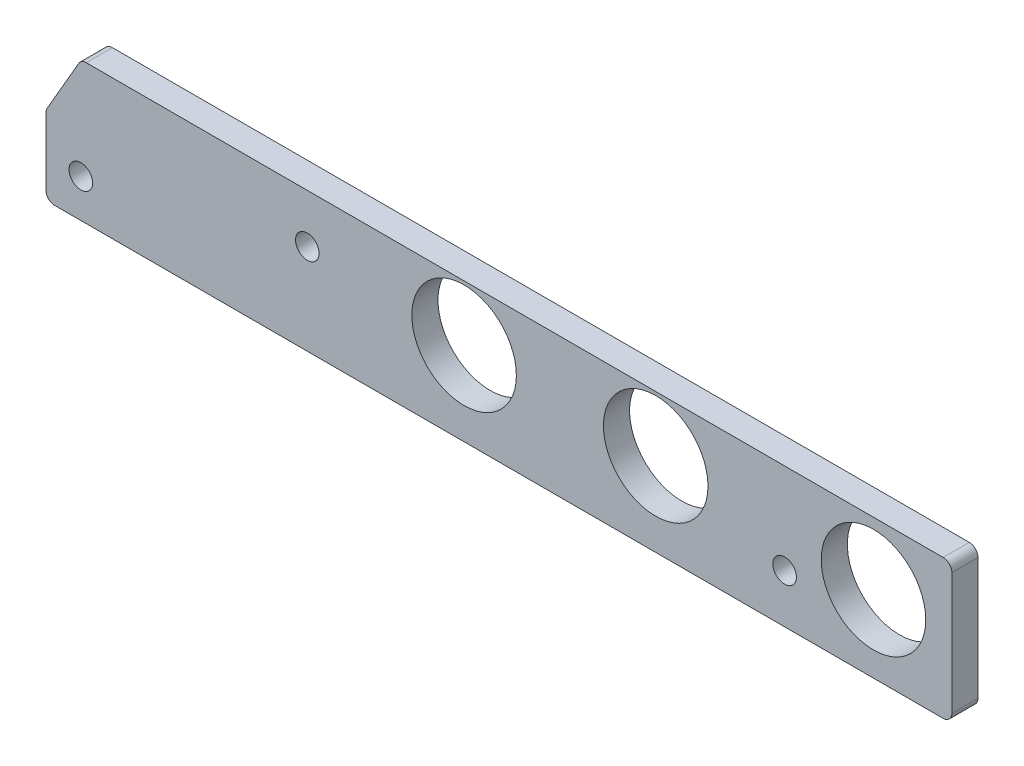
ISO-10303-21;
HEADER;
FILE_DESCRIPTION(('STEP AP214'),'2;1');
FILE_NAME('part.step','',(''),(''),'','','');
FILE_SCHEMA(('AUTOMOTIVE_DESIGN { 1 0 10303 214 1 1 1 1 }'));
ENDSEC;
DATA;
#1=APPLICATION_CONTEXT('core data for automotive mechanical design processes');
#2=APPLICATION_PROTOCOL_DEFINITION('international standard','automotive_design',2000,#1);
#3=PRODUCT_CONTEXT('',#1,'mechanical');
#4=PRODUCT('Part','Part','',(#3));
#5=PRODUCT_RELATED_PRODUCT_CATEGORY('part','',(#4));
#6=PRODUCT_DEFINITION_FORMATION('','',#4);
#7=PRODUCT_DEFINITION_CONTEXT('part definition',#1,'design');
#8=PRODUCT_DEFINITION('design','',#6,#7);
#9=PRODUCT_DEFINITION_SHAPE('','',#8);
#10=(LENGTH_UNIT() NAMED_UNIT(*) SI_UNIT(.MILLI.,.METRE.));
#11=(NAMED_UNIT(*) PLANE_ANGLE_UNIT() SI_UNIT($,.RADIAN.));
#12=(NAMED_UNIT(*) SI_UNIT($,.STERADIAN.) SOLID_ANGLE_UNIT());
#13=UNCERTAINTY_MEASURE_WITH_UNIT(LENGTH_MEASURE(1.E-05),#10,'distance_accuracy_value','');
#14=(GEOMETRIC_REPRESENTATION_CONTEXT(3) GLOBAL_UNCERTAINTY_ASSIGNED_CONTEXT((#13)) GLOBAL_UNIT_ASSIGNED_CONTEXT((#10,
#11,#12)) REPRESENTATION_CONTEXT('',''));
#15=CARTESIAN_POINT('',(0.,0.,0.));
#16=DIRECTION('',(0.,0.,1.));
#17=DIRECTION('',(1.,0.,0.));
#18=AXIS2_PLACEMENT_3D('',#15,#16,#17);
#19=CARTESIAN_POINT('',(-157.767651581292,-1.58749999999997,4.76249999999984));
#20=DIRECTION('',(0.,0.,-1.00000000000001));
#21=DIRECTION('',(-1.,0.,0.));
#22=AXIS2_PLACEMENT_3D('',#19,#20,#21);
#23=CYLINDRICAL_SURFACE('',#22,1.58749999999995);
#24=CARTESIAN_POINT('',(-157.767651581292,-1.58749999999998,-1.90819582357449E-13));
#25=DIRECTION('',(0.,0.,1.00000000000001));
#26=DIRECTION('',(1.,0.,0.));
#27=AXIS2_PLACEMENT_3D('',#24,#25,#26);
#28=CIRCLE('',#27,1.58749999999995);
#29=CARTESIAN_POINT('',(-157.767651581292,0.,-1.90819582357449E-13));
#30=VERTEX_POINT('',#29);
#31=CARTESIAN_POINT('',(-159.1424669098,-0.793749999999945,-1.90819582357449E-13));
#32=VERTEX_POINT('',#31);
#33=EDGE_CURVE('E144',#30,#32,#28,.T.);
#34=ORIENTED_EDGE('',*,*,#33,.T.);
#35=DIRECTION('',(0.,0.,-1.00000000000001));
#36=VECTOR('',#35,1.);
#37=CARTESIAN_POINT('',(-159.1424669098,-0.793749999999938,4.76249999999984));
#38=LINE('',#37,#36);
#39=CARTESIAN_POINT('',(-159.1424669098,-0.793749999999938,4.76249999999984));
#40=VERTEX_POINT('',#39);
#41=EDGE_CURVE('E11',#40,#32,#38,.T.);
#42=ORIENTED_EDGE('',*,*,#41,.F.);
#43=CARTESIAN_POINT('',(-157.767651581292,-1.58749999999997,4.76249999999984));
#44=DIRECTION('',(0.,0.,1.00000000000001));
#45=DIRECTION('',(1.,0.,0.));
#46=AXIS2_PLACEMENT_3D('',#43,#44,#45);
#47=CIRCLE('',#46,1.58749999999995);
#48=CARTESIAN_POINT('',(-157.767651581292,0.,4.76249999999984));
#49=VERTEX_POINT('',#48);
#50=EDGE_CURVE('E163',#49,#40,#47,.T.);
#51=ORIENTED_EDGE('',*,*,#50,.F.);
#52=DIRECTION('',(0.,0.,-1.00000000000001));
#53=VECTOR('',#52,1.);
#54=CARTESIAN_POINT('',(-157.767651581292,0.,4.76249999999984));
#55=LINE('',#54,#53);
#56=EDGE_CURVE('E140',#49,#30,#55,.T.);
#57=ORIENTED_EDGE('',*,*,#56,.T.);
#58=EDGE_LOOP('',(#34,#42,#51,#57));
#59=FACE_BOUND('',#58,.T.);
#60=ADVANCED_FACE('F36',(#59),#23,.T.);
#61=CARTESIAN_POINT('',(-159.1424669098,-0.793749999999938,4.76249999999984));
#62=DIRECTION('',(0.866025403784437,-0.5,0.));
#63=DIRECTION('',(0.5,0.866025403784441,0.));
#64=AXIS2_PLACEMENT_3D('',#61,#62,#63);
#65=PLANE('',#64);
#66=DIRECTION('',(-0.5,-0.866025403784441,0.));
#67=VECTOR('',#66,1.);
#68=CARTESIAN_POINT('',(-159.1424669098,-0.793749999999945,-1.90819582357449E-13));
#69=LINE('',#68,#67);
#70=CARTESIAN_POINT('',(-164.887315328508,-10.7441193429844,-2.0122792321331E-13));
#71=VERTEX_POINT('',#70);
#72=EDGE_CURVE('E147',#32,#71,#69,.T.);
#73=ORIENTED_EDGE('',*,*,#72,.T.);
#74=DIRECTION('',(0.,0.,-1.00000000000001));
#75=VECTOR('',#74,1.);
#76=CARTESIAN_POINT('',(-164.887315328508,-10.7441193429844,4.76249999999983));
#77=LINE('',#76,#75);
#78=CARTESIAN_POINT('',(-164.887315328508,-10.7441193429844,4.76249999999983));
#79=VERTEX_POINT('',#78);
#80=EDGE_CURVE('E44',#79,#71,#77,.T.);
#81=ORIENTED_EDGE('',*,*,#80,.F.);
#82=DIRECTION('',(-0.5,-0.866025403784441,0.));
#83=VECTOR('',#82,1.);
#84=CARTESIAN_POINT('',(-159.1424669098,-0.793749999999938,4.76249999999984));
#85=LINE('',#84,#83);
#86=EDGE_CURVE('E101',#40,#79,#85,.T.);
#87=ORIENTED_EDGE('',*,*,#86,.F.);
#88=ORIENTED_EDGE('',*,*,#41,.T.);
#89=EDGE_LOOP('',(#73,#81,#87,#88));
#90=FACE_BOUND('',#89,.T.);
#91=ADVANCED_FACE('F278',(#90),#65,.F.);
#92=CARTESIAN_POINT('',(-163.5125,-11.5378693429844,4.76249999999982));
#93=DIRECTION('',(0.,0.,-1.00000000000001));
#94=DIRECTION('',(-1.,0.,0.));
#95=AXIS2_PLACEMENT_3D('',#92,#93,#94);
#96=CYLINDRICAL_SURFACE('',#95,1.5875);
#97=CARTESIAN_POINT('',(-163.5125,-11.5378693429844,-2.0122792321331E-13));
#98=DIRECTION('',(0.,0.,1.00000000000001));
#99=DIRECTION('',(1.,0.,0.));
#100=AXIS2_PLACEMENT_3D('',#97,#98,#99);
#101=CIRCLE('',#100,1.5875);
#102=CARTESIAN_POINT('',(-165.1,-11.5378693429844,-2.04697370165263E-13));
#103=VERTEX_POINT('',#102);
#104=EDGE_CURVE('E150',#71,#103,#101,.T.);
#105=ORIENTED_EDGE('',*,*,#104,.T.);
#106=DIRECTION('',(0.,0.,-1.00000000000001));
#107=VECTOR('',#106,1.);
#108=CARTESIAN_POINT('',(-165.1,-11.5378693429844,4.76249999999982));
#109=LINE('',#108,#107);
#110=CARTESIAN_POINT('',(-165.1,-11.5378693429844,4.76249999999982));
#111=VERTEX_POINT('',#110);
#112=EDGE_CURVE('E176',#111,#103,#109,.T.);
#113=ORIENTED_EDGE('',*,*,#112,.F.);
#114=CARTESIAN_POINT('',(-163.5125,-11.5378693429844,4.76249999999982));
#115=DIRECTION('',(0.,0.,1.00000000000001));
#116=DIRECTION('',(1.,0.,0.));
#117=AXIS2_PLACEMENT_3D('',#114,#115,#116);
#118=CIRCLE('',#117,1.5875);
#119=EDGE_CURVE('E184',#79,#111,#118,.T.);
#120=ORIENTED_EDGE('',*,*,#119,.F.);
#121=ORIENTED_EDGE('',*,*,#80,.T.);
#122=EDGE_LOOP('',(#105,#113,#120,#121));
#123=FACE_BOUND('',#122,.T.);
#124=ADVANCED_FACE('F182',(#123),#96,.T.);
#125=CARTESIAN_POINT('',(-165.1,-11.5378693429844,4.76249999999982));
#126=DIRECTION('',(1.,0.,0.));
#127=DIRECTION('',(0.,0.,-1.00000000000001));
#128=AXIS2_PLACEMENT_3D('',#125,#126,#127);
#129=PLANE('',#128);
#130=DIRECTION('',(0.,-1.,0.));
#131=VECTOR('',#130,1.);
#132=CARTESIAN_POINT('',(-165.1,-11.5378693429844,-2.04697370165263E-13));
#133=LINE('',#132,#131);
#134=CARTESIAN_POINT('',(-165.1,-23.8125000000001,-2.39391839684799E-13));
#135=VERTEX_POINT('',#134);
#136=EDGE_CURVE('E152',#103,#135,#133,.T.);
#137=ORIENTED_EDGE('',*,*,#136,.T.);
#138=DIRECTION('',(0.,0.,-1.00000000000001));
#139=VECTOR('',#138,1.);
#140=CARTESIAN_POINT('',(-165.1,-23.8125000000001,4.76249999999978));
#141=LINE('',#140,#139);
#142=CARTESIAN_POINT('',(-165.1,-23.8125000000001,4.76249999999978));
#143=VERTEX_POINT('',#142);
#144=EDGE_CURVE('E173',#143,#135,#141,.T.);
#145=ORIENTED_EDGE('',*,*,#144,.F.);
#146=DIRECTION('',(0.,-1.,0.));
#147=VECTOR('',#146,1.);
#148=CARTESIAN_POINT('',(-165.1,-11.5378693429844,4.76249999999982));
#149=LINE('',#148,#147);
#150=EDGE_CURVE('E202',#111,#143,#149,.T.);
#151=ORIENTED_EDGE('',*,*,#150,.F.);
#152=ORIENTED_EDGE('',*,*,#112,.T.);
#153=EDGE_LOOP('',(#137,#145,#151,#152));
#154=FACE_BOUND('',#153,.T.);
#155=ADVANCED_FACE('F193',(#154),#129,.F.);
#156=CARTESIAN_POINT('',(-163.5125,-23.8125000000001,4.76249999999978));
#157=DIRECTION('',(0.,0.,-1.00000000000001));
#158=DIRECTION('',(-1.,0.,0.));
#159=AXIS2_PLACEMENT_3D('',#156,#157,#158);
#160=CYLINDRICAL_SURFACE('',#159,1.58749999999999);
#161=CARTESIAN_POINT('',(-163.5125,-23.8125000000001,-2.39391839684799E-13));
#162=DIRECTION('',(0.,0.,1.00000000000001));
#163=DIRECTION('',(1.,0.,0.));
#164=AXIS2_PLACEMENT_3D('',#161,#162,#163);
#165=CIRCLE('',#164,1.58749999999999);
#166=CARTESIAN_POINT('',(-163.5125,-25.4,-2.39391839684799E-13));
#167=VERTEX_POINT('',#166);
#168=EDGE_CURVE('E154',#135,#167,#165,.T.);
#169=ORIENTED_EDGE('',*,*,#168,.T.);
#170=DIRECTION('',(0.,0.,-1.00000000000001));
#171=VECTOR('',#170,1.);
#172=CARTESIAN_POINT('',(-163.5125,-25.4,4.76249999999978));
#173=LINE('',#172,#171);
#174=CARTESIAN_POINT('',(-163.5125,-25.4,4.76249999999978));
#175=VERTEX_POINT('',#174);
#176=EDGE_CURVE('E170',#175,#167,#173,.T.);
#177=ORIENTED_EDGE('',*,*,#176,.F.);
#178=CARTESIAN_POINT('',(-163.5125,-23.8125000000001,4.76249999999978));
#179=DIRECTION('',(0.,0.,1.00000000000001));
#180=DIRECTION('',(1.,0.,0.));
#181=AXIS2_PLACEMENT_3D('',#178,#179,#180);
#182=CIRCLE('',#181,1.58749999999999);
#183=EDGE_CURVE('E199',#143,#175,#182,.T.);
#184=ORIENTED_EDGE('',*,*,#183,.F.);
#185=ORIENTED_EDGE('',*,*,#144,.T.);
#186=EDGE_LOOP('',(#169,#177,#184,#185));
#187=FACE_BOUND('',#186,.T.);
#188=ADVANCED_FACE('F197',(#187),#160,.T.);
#189=CARTESIAN_POINT('',(-163.5125,-25.4,4.76249999999978));
#190=DIRECTION('',(0.,1.,0.));
#191=DIRECTION('',(-1.,0.,0.));
#192=AXIS2_PLACEMENT_3D('',#189,#190,#191);
#193=PLANE('',#192);
#194=DIRECTION('',(1.,0.,0.));
#195=VECTOR('',#194,1.);
#196=CARTESIAN_POINT('',(-163.5125,-25.4,-2.39391839684799E-13));
#197=LINE('',#196,#195);
#198=CARTESIAN_POINT('',(-1.5875,-25.4,0.));
#199=VERTEX_POINT('',#198);
#200=EDGE_CURVE('E156',#167,#199,#197,.T.);
#201=ORIENTED_EDGE('',*,*,#200,.T.);
#202=DIRECTION('',(0.,0.,-1.00000000000001));
#203=VECTOR('',#202,1.);
#204=CARTESIAN_POINT('',(-1.5875,-25.4,4.76249999999999));
#205=LINE('',#204,#203);
#206=CARTESIAN_POINT('',(-1.5875,-25.4,4.76249999999999));
#207=VERTEX_POINT('',#206);
#208=EDGE_CURVE('E167',#207,#199,#205,.T.);
#209=ORIENTED_EDGE('',*,*,#208,.F.);
#210=DIRECTION('',(1.,0.,0.));
#211=VECTOR('',#210,1.);
#212=CARTESIAN_POINT('',(-163.5125,-25.4,4.76249999999978));
#213=LINE('',#212,#211);
#214=EDGE_CURVE('E201',#175,#207,#213,.T.);
#215=ORIENTED_EDGE('',*,*,#214,.F.);
#216=ORIENTED_EDGE('',*,*,#176,.T.);
#217=EDGE_LOOP('',(#201,#209,#215,#216));
#218=FACE_BOUND('',#217,.T.);
#219=ADVANCED_FACE('F290',(#218),#193,.F.);
#220=CARTESIAN_POINT('',(-1.5875,-23.8125,4.7625));
#221=DIRECTION('',(0.,0.,-1.00000000000001));
#222=DIRECTION('',(-1.,0.,0.));
#223=AXIS2_PLACEMENT_3D('',#220,#221,#222);
#224=CYLINDRICAL_SURFACE('',#223,1.58749999999999);
#225=CARTESIAN_POINT('',(-1.5875,-23.8125,0.));
#226=DIRECTION('',(0.,0.,1.00000000000001));
#227=DIRECTION('',(1.,0.,0.));
#228=AXIS2_PLACEMENT_3D('',#225,#226,#227);
#229=CIRCLE('',#228,1.58749999999999);
#230=CARTESIAN_POINT('',(0.,-23.8125,0.));
#231=VERTEX_POINT('',#230);
#232=EDGE_CURVE('E158',#199,#231,#229,.T.);
#233=ORIENTED_EDGE('',*,*,#232,.T.);
#234=DIRECTION('',(0.,0.,-1.00000000000001));
#235=VECTOR('',#234,1.);
#236=CARTESIAN_POINT('',(0.,-23.8125,4.76249999999999));
#237=LINE('',#236,#235);
#238=CARTESIAN_POINT('',(0.,-23.8125,4.76249999999999));
#239=VERTEX_POINT('',#238);
#240=EDGE_CURVE('E135',#239,#231,#237,.T.);
#241=ORIENTED_EDGE('',*,*,#240,.F.);
#242=CARTESIAN_POINT('',(-1.5875,-23.8125,4.7625));
#243=DIRECTION('',(0.,0.,1.00000000000001));
#244=DIRECTION('',(1.,0.,0.));
#245=AXIS2_PLACEMENT_3D('',#242,#243,#244);
#246=CIRCLE('',#245,1.58749999999999);
#247=EDGE_CURVE('E126',#207,#239,#246,.T.);
#248=ORIENTED_EDGE('',*,*,#247,.F.);
#249=ORIENTED_EDGE('',*,*,#208,.T.);
#250=EDGE_LOOP('',(#233,#241,#248,#249));
#251=FACE_BOUND('',#250,.T.);
#252=ADVANCED_FACE('F287',(#251),#224,.T.);
#253=CARTESIAN_POINT('',(0.,-23.8125,4.76249999999999));
#254=DIRECTION('',(-1.,0.,0.));
#255=DIRECTION('',(0.,-1.,0.));
#256=AXIS2_PLACEMENT_3D('',#253,#254,#255);
#257=PLANE('',#256);
#258=DIRECTION('',(0.,1.,0.));
#259=VECTOR('',#258,1.);
#260=CARTESIAN_POINT('',(0.,-23.8125,0.));
#261=LINE('',#260,#259);
#262=CARTESIAN_POINT('',(0.,-1.5875,0.));
#263=VERTEX_POINT('',#262);
#264=EDGE_CURVE('E134',#231,#263,#261,.T.);
#265=ORIENTED_EDGE('',*,*,#264,.T.);
#266=DIRECTION('',(0.,0.,-1.00000000000001));
#267=VECTOR('',#266,1.);
#268=CARTESIAN_POINT('',(0.,-1.58749999999999,4.76250000000002));
#269=LINE('',#268,#267);
#270=CARTESIAN_POINT('',(0.,-1.58749999999999,4.76250000000002));
#271=VERTEX_POINT('',#270);
#272=EDGE_CURVE('E131',#271,#263,#269,.T.);
#273=ORIENTED_EDGE('',*,*,#272,.F.);
#274=DIRECTION('',(0.,1.,0.));
#275=VECTOR('',#274,1.);
#276=CARTESIAN_POINT('',(0.,-23.8125,4.76249999999999));
#277=LINE('',#276,#275);
#278=EDGE_CURVE('E120',#239,#271,#277,.T.);
#279=ORIENTED_EDGE('',*,*,#278,.F.);
#280=ORIENTED_EDGE('',*,*,#240,.T.);
#281=EDGE_LOOP('',(#265,#273,#279,#280));
#282=FACE_BOUND('',#281,.T.);
#283=ADVANCED_FACE('F132',(#282),#257,.F.);
#284=CARTESIAN_POINT('',(-1.5875,-1.58749999999999,4.76250000000002));
#285=DIRECTION('',(0.,0.,-1.00000000000001));
#286=DIRECTION('',(-1.,0.,0.));
#287=AXIS2_PLACEMENT_3D('',#284,#285,#286);
#288=CYLINDRICAL_SURFACE('',#287,1.58750000000001);
#289=CARTESIAN_POINT('',(-1.5875,-1.5875,0.));
#290=DIRECTION('',(0.,0.,1.00000000000001));
#291=DIRECTION('',(1.,0.,0.));
#292=AXIS2_PLACEMENT_3D('',#289,#290,#291);
#293=CIRCLE('',#292,1.58750000000001);
#294=CARTESIAN_POINT('',(-1.5875,0.,0.));
#295=VERTEX_POINT('',#294);
#296=EDGE_CURVE('E87',#263,#295,#293,.T.);
#297=ORIENTED_EDGE('',*,*,#296,.T.);
#298=DIRECTION('',(0.,0.,-1.00000000000001));
#299=VECTOR('',#298,1.);
#300=CARTESIAN_POINT('',(-1.58749999999999,0.,4.76250000000002));
#301=LINE('',#300,#299);
#302=CARTESIAN_POINT('',(-1.58749999999999,0.,4.76250000000002));
#303=VERTEX_POINT('',#302);
#304=EDGE_CURVE('E136',#303,#295,#301,.T.);
#305=ORIENTED_EDGE('',*,*,#304,.F.);
#306=CARTESIAN_POINT('',(-1.5875,-1.58749999999999,4.76250000000002));
#307=DIRECTION('',(0.,0.,1.00000000000001));
#308=DIRECTION('',(1.,0.,0.));
#309=AXIS2_PLACEMENT_3D('',#306,#307,#308);
#310=CIRCLE('',#309,1.58750000000001);
#311=EDGE_CURVE('E124',#271,#303,#310,.T.);
#312=ORIENTED_EDGE('',*,*,#311,.F.);
#313=ORIENTED_EDGE('',*,*,#272,.T.);
#314=EDGE_LOOP('',(#297,#305,#312,#313));
#315=FACE_BOUND('',#314,.T.);
#316=ADVANCED_FACE('F138',(#315),#288,.T.);
#317=CARTESIAN_POINT('',(-1.58749999999999,0.,4.76250000000002));
#318=DIRECTION('',(0.,-1.,0.));
#319=DIRECTION('',(1.,0.,0.));
#320=AXIS2_PLACEMENT_3D('',#317,#318,#319);
#321=PLANE('',#320);
#322=DIRECTION('',(-1.,0.,0.));
#323=VECTOR('',#322,1.);
#324=CARTESIAN_POINT('',(-1.5875,0.,0.));
#325=LINE('',#324,#323);
#326=EDGE_CURVE('E93',#295,#30,#325,.T.);
#327=ORIENTED_EDGE('',*,*,#326,.T.);
#328=ORIENTED_EDGE('',*,*,#56,.F.);
#329=DIRECTION('',(-1.,0.,0.));
#330=VECTOR('',#329,1.);
#331=CARTESIAN_POINT('',(-1.58749999999999,0.,4.76250000000002));
#332=LINE('',#331,#330);
#333=EDGE_CURVE('E52',#303,#49,#332,.T.);
#334=ORIENTED_EDGE('',*,*,#333,.F.);
#335=ORIENTED_EDGE('',*,*,#304,.T.);
#336=EDGE_LOOP('',(#327,#328,#334,#335));
#337=FACE_BOUND('',#336,.T.);
#338=ADVANCED_FACE('F250',(#337),#321,.F.);
#339=CARTESIAN_POINT('',(-157.767651581292,-1.58749999999997,4.76249999999984));
#340=DIRECTION('',(0.,0.,1.00000000000001));
#341=DIRECTION('',(1.,0.,0.));
#342=AXIS2_PLACEMENT_3D('',#339,#340,#341);
#343=PLANE('',#342);
#344=CARTESIAN_POINT('',(-88.9000000000001,-10.16,4.76249999999992));
#345=DIRECTION('',(0.,0.,1.00000000000001));
#346=DIRECTION('',(1.,0.,0.));
#347=AXIS2_PLACEMENT_3D('',#344,#345,#346);
#348=CIRCLE('',#347,9.52500000000001);
#349=CARTESIAN_POINT('',(-79.3750000000001,-10.16,4.76249999999993));
#350=VERTEX_POINT('',#349);
#351=EDGE_CURVE('E242',#350,#350,#348,.T.);
#352=ORIENTED_EDGE('',*,*,#351,.F.);
#353=EDGE_LOOP('',(#352));
#354=FACE_BOUND('',#353,.T.);
#355=CARTESIAN_POINT('',(-53.9750000000004,-10.1599999999995,4.76249999999994));
#356=DIRECTION('',(0.,0.,1.00000000000001));
#357=DIRECTION('',(1.,0.,0.));
#358=AXIS2_PLACEMENT_3D('',#355,#356,#357);
#359=CIRCLE('',#358,9.525);
#360=CARTESIAN_POINT('',(-44.4500000000004,-10.1599999999995,4.76249999999995));
#361=VERTEX_POINT('',#360);
#362=EDGE_CURVE('E236',#361,#361,#359,.T.);
#363=ORIENTED_EDGE('',*,*,#362,.F.);
#364=EDGE_LOOP('',(#363));
#365=FACE_BOUND('',#364,.T.);
#366=CARTESIAN_POINT('',(-14.2875,-11.4299999999998,4.7625));
#367=DIRECTION('',(0.,0.,1.00000000000001));
#368=DIRECTION('',(1.,0.,0.));
#369=AXIS2_PLACEMENT_3D('',#366,#367,#368);
#370=CIRCLE('',#369,9.525);
#371=CARTESIAN_POINT('',(-4.76249999999996,-11.4299999999998,4.76250000000001));
#372=VERTEX_POINT('',#371);
#373=EDGE_CURVE('E230',#372,#372,#370,.T.);
#374=ORIENTED_EDGE('',*,*,#373,.F.);
#375=EDGE_LOOP('',(#374));
#376=FACE_BOUND('',#375,.T.);
#377=CARTESIAN_POINT('',(-158.75,-18.415,4.7624999999998));
#378=DIRECTION('',(0.,0.,1.00000000000001));
#379=DIRECTION('',(1.,0.,0.));
#380=AXIS2_PLACEMENT_3D('',#377,#378,#379);
#381=CIRCLE('',#380,2.15264999999998);
#382=CARTESIAN_POINT('',(-156.59735,-18.415,4.7624999999998));
#383=VERTEX_POINT('',#382);
#384=EDGE_CURVE('E224',#383,#383,#381,.T.);
#385=ORIENTED_EDGE('',*,*,#384,.F.);
#386=EDGE_LOOP('',(#385));
#387=FACE_BOUND('',#386,.T.);
#388=CARTESIAN_POINT('',(-117.475,-8.89,4.76249999999988));
#389=DIRECTION('',(0.,0.,1.00000000000001));
#390=DIRECTION('',(1.,0.,0.));
#391=AXIS2_PLACEMENT_3D('',#388,#389,#390);
#392=CIRCLE('',#391,2.15264999999999);
#393=CARTESIAN_POINT('',(-115.32235,-8.89,4.76249999999988));
#394=VERTEX_POINT('',#393);
#395=EDGE_CURVE('E218',#394,#394,#392,.T.);
#396=ORIENTED_EDGE('',*,*,#395,.F.);
#397=EDGE_LOOP('',(#396));
#398=FACE_BOUND('',#397,.T.);
#399=CARTESIAN_POINT('',(-30.48,-16.51,4.76249999999999));
#400=DIRECTION('',(0.,0.,1.00000000000001));
#401=DIRECTION('',(1.,0.,0.));
#402=AXIS2_PLACEMENT_3D('',#399,#400,#401);
#403=CIRCLE('',#402,2.15264999999999);
#404=CARTESIAN_POINT('',(-28.3273500000001,-16.51,4.76249999999999));
#405=VERTEX_POINT('',#404);
#406=EDGE_CURVE('E212',#405,#405,#403,.T.);
#407=ORIENTED_EDGE('',*,*,#406,.F.);
#408=EDGE_LOOP('',(#407));
#409=FACE_BOUND('',#408,.T.);
#410=ORIENTED_EDGE('',*,*,#50,.T.);
#411=ORIENTED_EDGE('',*,*,#86,.T.);
#412=ORIENTED_EDGE('',*,*,#119,.T.);
#413=ORIENTED_EDGE('',*,*,#150,.T.);
#414=ORIENTED_EDGE('',*,*,#183,.T.);
#415=ORIENTED_EDGE('',*,*,#214,.T.);
#416=ORIENTED_EDGE('',*,*,#247,.T.);
#417=ORIENTED_EDGE('',*,*,#278,.T.);
#418=ORIENTED_EDGE('',*,*,#311,.T.);
#419=ORIENTED_EDGE('',*,*,#333,.T.);
#420=EDGE_LOOP('',(#410,#411,#412,#413,#414,#415,#416,#417,#418,#419));
#421=FACE_BOUND('',#420,.T.);
#422=ADVANCED_FACE('F122',(#354,#365,#376,#387,#398,#409,#421),#343,.T.);
#423=CARTESIAN_POINT('',(-157.767651581292,-1.58749999999998,-1.90819582357449E-13));
#424=DIRECTION('',(0.,0.,1.00000000000001));
#425=DIRECTION('',(1.,0.,0.));
#426=AXIS2_PLACEMENT_3D('',#423,#424,#425);
#427=PLANE('',#426);
#428=CARTESIAN_POINT('',(-88.9000000000001,-10.16,-1.21430643318376E-13));
#429=DIRECTION('',(0.,0.,1.00000000000001));
#430=DIRECTION('',(1.,0.,0.));
#431=AXIS2_PLACEMENT_3D('',#428,#429,#430);
#432=CIRCLE('',#431,9.52500000000001);
#433=CARTESIAN_POINT('',(-79.3750000000001,-10.16,-1.10433667616089E-13));
#434=VERTEX_POINT('',#433);
#435=EDGE_CURVE('E239',#434,#434,#432,.T.);
#436=ORIENTED_EDGE('',*,*,#435,.T.);
#437=EDGE_LOOP('',(#436));
#438=FACE_BOUND('',#437,.T.);
#439=CARTESIAN_POINT('',(-53.9750000000004,-10.1599999999995,0.));
#440=DIRECTION('',(0.,0.,1.00000000000001));
#441=DIRECTION('',(1.,0.,0.));
#442=AXIS2_PLACEMENT_3D('',#439,#440,#441);
#443=CIRCLE('',#442,9.525);
#444=CARTESIAN_POINT('',(-44.4500000000004,-10.1599999999995,0.));
#445=VERTEX_POINT('',#444);
#446=EDGE_CURVE('E233',#445,#445,#443,.T.);
#447=ORIENTED_EDGE('',*,*,#446,.T.);
#448=EDGE_LOOP('',(#447));
#449=FACE_BOUND('',#448,.T.);
#450=CARTESIAN_POINT('',(-14.2875,-11.4299999999998,0.));
#451=DIRECTION('',(0.,0.,1.00000000000001));
#452=DIRECTION('',(1.,0.,0.));
#453=AXIS2_PLACEMENT_3D('',#450,#451,#452);
#454=CIRCLE('',#453,9.525);
#455=CARTESIAN_POINT('',(-4.76249999999996,-11.4299999999998,0.));
#456=VERTEX_POINT('',#455);
#457=EDGE_CURVE('E227',#456,#456,#454,.T.);
#458=ORIENTED_EDGE('',*,*,#457,.T.);
#459=EDGE_LOOP('',(#458));
#460=FACE_BOUND('',#459,.T.);
#461=CARTESIAN_POINT('',(-158.75,-18.415,-2.28983498828939E-13));
#462=DIRECTION('',(0.,0.,1.00000000000001));
#463=DIRECTION('',(1.,0.,0.));
#464=AXIS2_PLACEMENT_3D('',#461,#462,#463);
#465=CIRCLE('',#464,2.15265000000001);
#466=CARTESIAN_POINT('',(-156.59735,-18.415,-2.26498182320222E-13));
#467=VERTEX_POINT('',#466);
#468=EDGE_CURVE('E221',#467,#467,#465,.T.);
#469=ORIENTED_EDGE('',*,*,#468,.T.);
#470=EDGE_LOOP('',(#469));
#471=FACE_BOUND('',#470,.T.);
#472=CARTESIAN_POINT('',(-117.475,-8.89,-1.6306400674182E-13));
#473=DIRECTION('',(0.,0.,1.00000000000001));
#474=DIRECTION('',(1.,0.,0.));
#475=AXIS2_PLACEMENT_3D('',#472,#473,#474);
#476=CIRCLE('',#475,2.15265000000001);
#477=CARTESIAN_POINT('',(-115.32235,-8.89,-1.60578690233103E-13));
#478=VERTEX_POINT('',#477);
#479=EDGE_CURVE('E215',#478,#478,#476,.T.);
#480=ORIENTED_EDGE('',*,*,#479,.T.);
#481=EDGE_LOOP('',(#480));
#482=FACE_BOUND('',#481,.T.);
#483=CARTESIAN_POINT('',(-30.48,-16.51,0.));
#484=DIRECTION('',(0.,0.,1.00000000000001));
#485=DIRECTION('',(1.,0.,0.));
#486=AXIS2_PLACEMENT_3D('',#483,#484,#485);
#487=CIRCLE('',#486,2.15265);
#488=CARTESIAN_POINT('',(-28.32735,-16.51,0.));
#489=VERTEX_POINT('',#488);
#490=EDGE_CURVE('E148',#489,#489,#487,.T.);
#491=ORIENTED_EDGE('',*,*,#490,.T.);
#492=EDGE_LOOP('',(#491));
#493=FACE_BOUND('',#492,.T.);
#494=ORIENTED_EDGE('',*,*,#33,.F.);
#495=ORIENTED_EDGE('',*,*,#326,.F.);
#496=ORIENTED_EDGE('',*,*,#296,.F.);
#497=ORIENTED_EDGE('',*,*,#264,.F.);
#498=ORIENTED_EDGE('',*,*,#232,.F.);
#499=ORIENTED_EDGE('',*,*,#200,.F.);
#500=ORIENTED_EDGE('',*,*,#168,.F.);
#501=ORIENTED_EDGE('',*,*,#136,.F.);
#502=ORIENTED_EDGE('',*,*,#104,.F.);
#503=ORIENTED_EDGE('',*,*,#72,.F.);
#504=EDGE_LOOP('',(#494,#495,#496,#497,#498,#499,#500,#501,#502,#503));
#505=FACE_BOUND('',#504,.T.);
#506=ADVANCED_FACE('F188',(#438,#449,#460,#471,#482,#493,#505),#427,.F.);
#507=CARTESIAN_POINT('',(-30.48,-16.51,4.76249999999999));
#508=DIRECTION('',(0.,0.,1.00000000000001));
#509=DIRECTION('',(1.,0.,0.));
#510=AXIS2_PLACEMENT_3D('',#507,#508,#509);
#511=CYLINDRICAL_SURFACE('',#510,2.15264999999999);
#512=ORIENTED_EDGE('',*,*,#490,.F.);
#513=EDGE_LOOP('',(#512));
#514=FACE_BOUND('',#513,.T.);
#515=ORIENTED_EDGE('',*,*,#406,.T.);
#516=EDGE_LOOP('',(#515));
#517=FACE_BOUND('',#516,.T.);
#518=ADVANCED_FACE('F262',(#514,#517),#511,.F.);
#519=CARTESIAN_POINT('',(-117.475,-8.89,4.76249999999987));
#520=DIRECTION('',(0.,0.,1.00000000000001));
#521=DIRECTION('',(1.,0.,0.));
#522=AXIS2_PLACEMENT_3D('',#519,#520,#521);
#523=CYLINDRICAL_SURFACE('',#522,2.15265);
#524=ORIENTED_EDGE('',*,*,#479,.F.);
#525=EDGE_LOOP('',(#524));
#526=FACE_BOUND('',#525,.T.);
#527=ORIENTED_EDGE('',*,*,#395,.T.);
#528=EDGE_LOOP('',(#527));
#529=FACE_BOUND('',#528,.T.);
#530=ADVANCED_FACE('F264',(#526,#529),#523,.F.);
#531=CARTESIAN_POINT('',(-158.75,-18.415,4.7624999999998));
#532=DIRECTION('',(0.,0.,1.00000000000001));
#533=DIRECTION('',(1.,0.,0.));
#534=AXIS2_PLACEMENT_3D('',#531,#532,#533);
#535=CYLINDRICAL_SURFACE('',#534,2.15264999999999);
#536=ORIENTED_EDGE('',*,*,#468,.F.);
#537=EDGE_LOOP('',(#536));
#538=FACE_BOUND('',#537,.T.);
#539=ORIENTED_EDGE('',*,*,#384,.T.);
#540=EDGE_LOOP('',(#539));
#541=FACE_BOUND('',#540,.T.);
#542=ADVANCED_FACE('F271',(#538,#541),#535,.F.);
#543=CARTESIAN_POINT('',(-14.2875,-11.4299999999998,4.7625));
#544=DIRECTION('',(0.,0.,1.00000000000001));
#545=DIRECTION('',(1.,0.,0.));
#546=AXIS2_PLACEMENT_3D('',#543,#544,#545);
#547=CYLINDRICAL_SURFACE('',#546,9.525);
#548=ORIENTED_EDGE('',*,*,#457,.F.);
#549=EDGE_LOOP('',(#548));
#550=FACE_BOUND('',#549,.T.);
#551=ORIENTED_EDGE('',*,*,#373,.T.);
#552=EDGE_LOOP('',(#551));
#553=FACE_BOUND('',#552,.T.);
#554=ADVANCED_FACE('F380',(#550,#553),#547,.F.);
#555=CARTESIAN_POINT('',(-53.9750000000004,-10.1599999999995,4.76249999999994));
#556=DIRECTION('',(0.,0.,1.00000000000001));
#557=DIRECTION('',(1.,0.,0.));
#558=AXIS2_PLACEMENT_3D('',#555,#556,#557);
#559=CYLINDRICAL_SURFACE('',#558,9.525);
#560=ORIENTED_EDGE('',*,*,#446,.F.);
#561=EDGE_LOOP('',(#560));
#562=FACE_BOUND('',#561,.T.);
#563=ORIENTED_EDGE('',*,*,#362,.T.);
#564=EDGE_LOOP('',(#563));
#565=FACE_BOUND('',#564,.T.);
#566=ADVANCED_FACE('F390',(#562,#565),#559,.F.);
#567=CARTESIAN_POINT('',(-88.9000000000001,-10.16,4.76249999999992));
#568=DIRECTION('',(0.,0.,1.00000000000001));
#569=DIRECTION('',(1.,0.,0.));
#570=AXIS2_PLACEMENT_3D('',#567,#568,#569);
#571=CYLINDRICAL_SURFACE('',#570,9.52500000000001);
#572=ORIENTED_EDGE('',*,*,#435,.F.);
#573=EDGE_LOOP('',(#572));
#574=FACE_BOUND('',#573,.T.);
#575=ORIENTED_EDGE('',*,*,#351,.T.);
#576=EDGE_LOOP('',(#575));
#577=FACE_BOUND('',#576,.T.);
#578=ADVANCED_FACE('F246',(#574,#577),#571,.F.);
#579=CLOSED_SHELL('',(#60,#91,#124,#155,#188,#219,#252,#283,#316,#338,#422,#506,#518,#530,#542,
#554,#566,#578));
#580=MANIFOLD_SOLID_BREP('B2',#579);
#581=ADVANCED_BREP_SHAPE_REPRESENTATION('',(#18,#580),#14);
#582=SHAPE_DEFINITION_REPRESENTATION(#9,#581);
ENDSEC;
END-ISO-10303-21;
